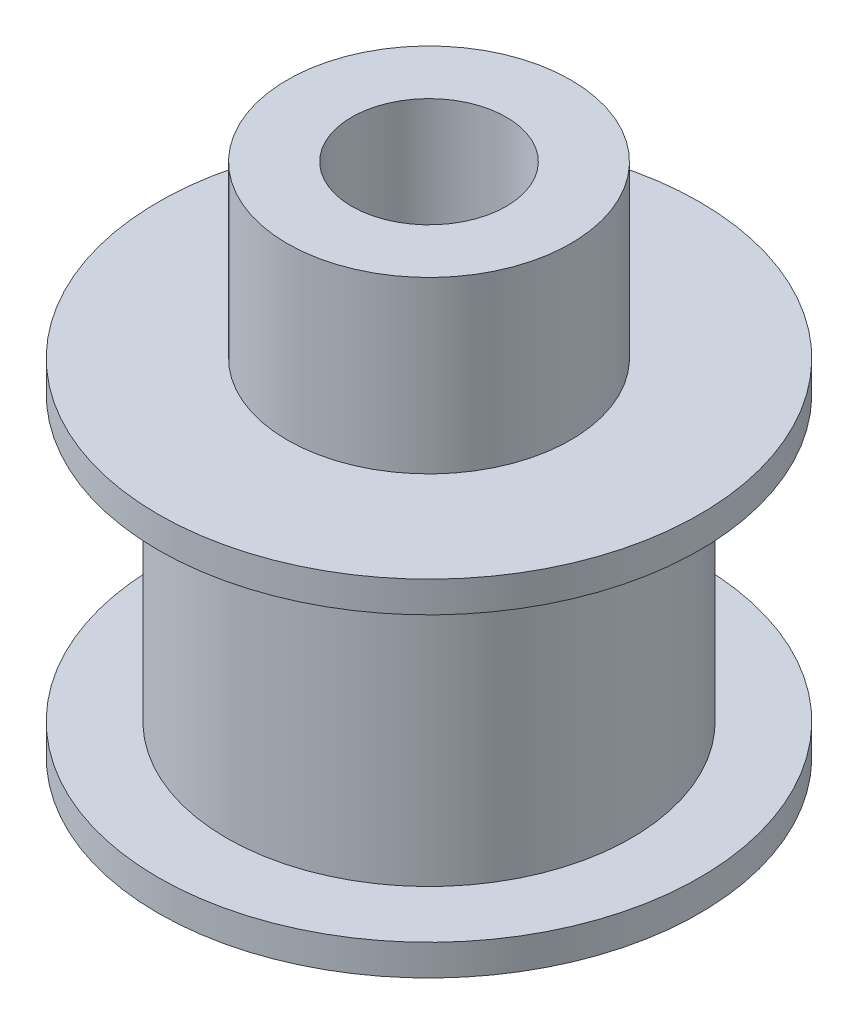
ISO-10303-21;
HEADER;
FILE_DESCRIPTION(('STEP AP214'),'2;1');
FILE_NAME('part.step','',(''),(''),'','','');
FILE_SCHEMA(('AUTOMOTIVE_DESIGN { 1 0 10303 214 1 1 1 1 }'));
ENDSEC;
DATA;
#1=APPLICATION_CONTEXT('core data for automotive mechanical design processes');
#2=APPLICATION_PROTOCOL_DEFINITION('international standard','automotive_design',2000,#1);
#3=PRODUCT_CONTEXT('',#1,'mechanical');
#4=PRODUCT('Part','Part','',(#3));
#5=PRODUCT_RELATED_PRODUCT_CATEGORY('part','',(#4));
#6=PRODUCT_DEFINITION_FORMATION('','',#4);
#7=PRODUCT_DEFINITION_CONTEXT('part definition',#1,'design');
#8=PRODUCT_DEFINITION('design','',#6,#7);
#9=PRODUCT_DEFINITION_SHAPE('','',#8);
#10=(LENGTH_UNIT() NAMED_UNIT(*) SI_UNIT(.MILLI.,.METRE.));
#11=(NAMED_UNIT(*) PLANE_ANGLE_UNIT() SI_UNIT($,.RADIAN.));
#12=(NAMED_UNIT(*) SI_UNIT($,.STERADIAN.) SOLID_ANGLE_UNIT());
#13=UNCERTAINTY_MEASURE_WITH_UNIT(LENGTH_MEASURE(1.E-05),#10,'distance_accuracy_value','');
#14=(GEOMETRIC_REPRESENTATION_CONTEXT(3) GLOBAL_UNCERTAINTY_ASSIGNED_CONTEXT((#13)) GLOBAL_UNIT_ASSIGNED_CONTEXT((#10,
#11,#12)) REPRESENTATION_CONTEXT('',''));
#15=CARTESIAN_POINT('',(0.,0.,0.));
#16=DIRECTION('',(0.,0.,1.));
#17=DIRECTION('',(1.,0.,0.));
#18=AXIS2_PLACEMENT_3D('',#15,#16,#17);
#19=CARTESIAN_POINT('',(0.,1.2,0.));
#20=DIRECTION('',(0.,-1.,0.));
#21=DIRECTION('',(0.,0.,-1.));
#22=AXIS2_PLACEMENT_3D('',#19,#20,#21);
#23=CYLINDRICAL_SURFACE('',#22,10.5);
#24=CARTESIAN_POINT('',(0.,1.2,0.));
#25=DIRECTION('',(0.,1.,0.));
#26=DIRECTION('',(0.,0.,1.));
#27=AXIS2_PLACEMENT_3D('',#24,#25,#26);
#28=CIRCLE('',#27,10.5);
#29=CARTESIAN_POINT('',(0.,1.2,10.5));
#30=VERTEX_POINT('',#29);
#31=EDGE_CURVE('E10',#30,#30,#28,.T.);
#32=ORIENTED_EDGE('',*,*,#31,.F.);
#33=EDGE_LOOP('',(#32));
#34=FACE_BOUND('',#33,.T.);
#35=CARTESIAN_POINT('',(0.,0.,0.));
#36=DIRECTION('',(0.,1.,0.));
#37=DIRECTION('',(0.,0.,1.));
#38=AXIS2_PLACEMENT_3D('',#35,#36,#37);
#39=CIRCLE('',#38,10.5);
#40=CARTESIAN_POINT('',(0.,0.,10.5));
#41=VERTEX_POINT('',#40);
#42=EDGE_CURVE('E33',#41,#41,#39,.T.);
#43=ORIENTED_EDGE('',*,*,#42,.T.);
#44=EDGE_LOOP('',(#43));
#45=FACE_BOUND('',#44,.T.);
#46=ADVANCED_FACE('F30',(#34,#45),#23,.T.);
#47=CARTESIAN_POINT('',(0.,1.2,0.));
#48=DIRECTION('',(0.,1.,0.));
#49=DIRECTION('',(0.,0.,1.));
#50=AXIS2_PLACEMENT_3D('',#47,#48,#49);
#51=PLANE('',#50);
#52=CARTESIAN_POINT('',(0.,1.2,0.));
#53=DIRECTION('',(0.,1.,0.));
#54=DIRECTION('',(0.,0.,1.));
#55=AXIS2_PLACEMENT_3D('',#52,#53,#54);
#56=CIRCLE('',#55,7.85);
#57=CARTESIAN_POINT('',(0.,1.2,7.85));
#58=VERTEX_POINT('',#57);
#59=EDGE_CURVE('E42',#58,#58,#56,.T.);
#60=ORIENTED_EDGE('',*,*,#59,.F.);
#61=EDGE_LOOP('',(#60));
#62=FACE_BOUND('',#61,.T.);
#63=ORIENTED_EDGE('',*,*,#31,.T.);
#64=EDGE_LOOP('',(#63));
#65=FACE_BOUND('',#64,.T.);
#66=ADVANCED_FACE('F107',(#62,#65),#51,.T.);
#67=CARTESIAN_POINT('',(0.,0.,0.));
#68=DIRECTION('',(0.,1.,0.));
#69=DIRECTION('',(0.,0.,1.));
#70=AXIS2_PLACEMENT_3D('',#67,#68,#69);
#71=PLANE('',#70);
#72=CARTESIAN_POINT('',(0.,0.,0.));
#73=DIRECTION('',(0.,1.,0.));
#74=DIRECTION('',(0.,0.,1.));
#75=AXIS2_PLACEMENT_3D('',#72,#73,#74);
#76=CIRCLE('',#75,3.);
#77=CARTESIAN_POINT('',(0.,0.,3.));
#78=VERTEX_POINT('',#77);
#79=EDGE_CURVE('E57',#78,#78,#76,.T.);
#80=ORIENTED_EDGE('',*,*,#79,.T.);
#81=EDGE_LOOP('',(#80));
#82=FACE_BOUND('',#81,.T.);
#83=ORIENTED_EDGE('',*,*,#42,.F.);
#84=EDGE_LOOP('',(#83));
#85=FACE_BOUND('',#84,.T.);
#86=ADVANCED_FACE('F66',(#82,#85),#71,.F.);
#87=CARTESIAN_POINT('',(0.,12.2,0.));
#88=DIRECTION('',(0.,-1.,0.));
#89=DIRECTION('',(0.,0.,-1.));
#90=AXIS2_PLACEMENT_3D('',#87,#88,#89);
#91=CYLINDRICAL_SURFACE('',#90,7.85);
#92=CARTESIAN_POINT('',(0.,12.2,0.));
#93=DIRECTION('',(0.,1.,0.));
#94=DIRECTION('',(0.,0.,1.));
#95=AXIS2_PLACEMENT_3D('',#92,#93,#94);
#96=CIRCLE('',#95,7.85);
#97=CARTESIAN_POINT('',(0.,12.2,7.85));
#98=VERTEX_POINT('',#97);
#99=EDGE_CURVE('E40',#98,#98,#96,.T.);
#100=ORIENTED_EDGE('',*,*,#99,.F.);
#101=EDGE_LOOP('',(#100));
#102=FACE_BOUND('',#101,.T.);
#103=ORIENTED_EDGE('',*,*,#59,.T.);
#104=EDGE_LOOP('',(#103));
#105=FACE_BOUND('',#104,.T.);
#106=ADVANCED_FACE('F97',(#102,#105),#91,.T.);
#107=CARTESIAN_POINT('',(0.,13.4,0.));
#108=DIRECTION('',(0.,-1.,0.));
#109=DIRECTION('',(0.,0.,-1.));
#110=AXIS2_PLACEMENT_3D('',#107,#108,#109);
#111=CYLINDRICAL_SURFACE('',#110,10.5);
#112=CARTESIAN_POINT('',(0.,13.4,0.));
#113=DIRECTION('',(0.,1.,0.));
#114=DIRECTION('',(0.,0.,1.));
#115=AXIS2_PLACEMENT_3D('',#112,#113,#114);
#116=CIRCLE('',#115,10.5);
#117=CARTESIAN_POINT('',(0.,13.4,10.5));
#118=VERTEX_POINT('',#117);
#119=EDGE_CURVE('E45',#118,#118,#116,.T.);
#120=ORIENTED_EDGE('',*,*,#119,.F.);
#121=EDGE_LOOP('',(#120));
#122=FACE_BOUND('',#121,.T.);
#123=CARTESIAN_POINT('',(0.,12.2,0.));
#124=DIRECTION('',(0.,1.,0.));
#125=DIRECTION('',(0.,0.,1.));
#126=AXIS2_PLACEMENT_3D('',#123,#124,#125);
#127=CIRCLE('',#126,10.5);
#128=CARTESIAN_POINT('',(0.,12.2,10.5));
#129=VERTEX_POINT('',#128);
#130=EDGE_CURVE('E48',#129,#129,#127,.T.);
#131=ORIENTED_EDGE('',*,*,#130,.T.);
#132=EDGE_LOOP('',(#131));
#133=FACE_BOUND('',#132,.T.);
#134=ADVANCED_FACE('F91',(#122,#133),#111,.T.);
#135=CARTESIAN_POINT('',(0.,13.4,0.));
#136=DIRECTION('',(0.,1.,0.));
#137=DIRECTION('',(0.,0.,1.));
#138=AXIS2_PLACEMENT_3D('',#135,#136,#137);
#139=PLANE('',#138);
#140=CARTESIAN_POINT('',(0.,13.4,0.));
#141=DIRECTION('',(0.,1.,0.));
#142=DIRECTION('',(0.,0.,1.));
#143=AXIS2_PLACEMENT_3D('',#140,#141,#142);
#144=CIRCLE('',#143,5.5);
#145=CARTESIAN_POINT('',(0.,13.4,5.5));
#146=VERTEX_POINT('',#145);
#147=EDGE_CURVE('E54',#146,#146,#144,.T.);
#148=ORIENTED_EDGE('',*,*,#147,.F.);
#149=EDGE_LOOP('',(#148));
#150=FACE_BOUND('',#149,.T.);
#151=ORIENTED_EDGE('',*,*,#119,.T.);
#152=EDGE_LOOP('',(#151));
#153=FACE_BOUND('',#152,.T.);
#154=ADVANCED_FACE('F88',(#150,#153),#139,.T.);
#155=CARTESIAN_POINT('',(0.,12.2,0.));
#156=DIRECTION('',(0.,1.,0.));
#157=DIRECTION('',(0.,0.,1.));
#158=AXIS2_PLACEMENT_3D('',#155,#156,#157);
#159=PLANE('',#158);
#160=ORIENTED_EDGE('',*,*,#99,.T.);
#161=EDGE_LOOP('',(#160));
#162=FACE_BOUND('',#161,.T.);
#163=ORIENTED_EDGE('',*,*,#130,.F.);
#164=EDGE_LOOP('',(#163));
#165=FACE_BOUND('',#164,.T.);
#166=ADVANCED_FACE('F84',(#162,#165),#159,.F.);
#167=CARTESIAN_POINT('',(0.,20.,0.));
#168=DIRECTION('',(0.,-1.,0.));
#169=DIRECTION('',(0.,0.,-1.));
#170=AXIS2_PLACEMENT_3D('',#167,#168,#169);
#171=CYLINDRICAL_SURFACE('',#170,5.5);
#172=CARTESIAN_POINT('',(0.,20.,0.));
#173=DIRECTION('',(0.,1.,0.));
#174=DIRECTION('',(0.,0.,1.));
#175=AXIS2_PLACEMENT_3D('',#172,#173,#174);
#176=CIRCLE('',#175,5.5);
#177=CARTESIAN_POINT('',(0.,20.,5.5));
#178=VERTEX_POINT('',#177);
#179=EDGE_CURVE('E51',#178,#178,#176,.T.);
#180=ORIENTED_EDGE('',*,*,#179,.F.);
#181=EDGE_LOOP('',(#180));
#182=FACE_BOUND('',#181,.T.);
#183=ORIENTED_EDGE('',*,*,#147,.T.);
#184=EDGE_LOOP('',(#183));
#185=FACE_BOUND('',#184,.T.);
#186=ADVANCED_FACE('F78',(#182,#185),#171,.T.);
#187=CARTESIAN_POINT('',(0.,20.,0.));
#188=DIRECTION('',(0.,1.,0.));
#189=DIRECTION('',(0.,0.,1.));
#190=AXIS2_PLACEMENT_3D('',#187,#188,#189);
#191=PLANE('',#190);
#192=CARTESIAN_POINT('',(0.,20.,0.));
#193=DIRECTION('',(0.,1.,0.));
#194=DIRECTION('',(0.,0.,1.));
#195=AXIS2_PLACEMENT_3D('',#192,#193,#194);
#196=CIRCLE('',#195,3.);
#197=CARTESIAN_POINT('',(0.,20.,3.));
#198=VERTEX_POINT('',#197);
#199=EDGE_CURVE('E60',#198,#198,#196,.T.);
#200=ORIENTED_EDGE('',*,*,#199,.F.);
#201=EDGE_LOOP('',(#200));
#202=FACE_BOUND('',#201,.T.);
#203=ORIENTED_EDGE('',*,*,#179,.T.);
#204=EDGE_LOOP('',(#203));
#205=FACE_BOUND('',#204,.T.);
#206=ADVANCED_FACE('F72',(#202,#205),#191,.T.);
#207=CARTESIAN_POINT('',(0.,0.,0.));
#208=DIRECTION('',(0.,1.,0.));
#209=DIRECTION('',(0.,0.,1.));
#210=AXIS2_PLACEMENT_3D('',#207,#208,#209);
#211=CYLINDRICAL_SURFACE('',#210,3.);
#212=ORIENTED_EDGE('',*,*,#79,.F.);
#213=EDGE_LOOP('',(#212));
#214=FACE_BOUND('',#213,.T.);
#215=ORIENTED_EDGE('',*,*,#199,.T.);
#216=EDGE_LOOP('',(#215));
#217=FACE_BOUND('',#216,.T.);
#218=ADVANCED_FACE('F69',(#214,#217),#211,.F.);
#219=CLOSED_SHELL('',(#46,#66,#86,#106,#134,#154,#166,#186,#206,#218));
#220=MANIFOLD_SOLID_BREP('B2',#219);
#221=ADVANCED_BREP_SHAPE_REPRESENTATION('',(#18,#220),#14);
#222=SHAPE_DEFINITION_REPRESENTATION(#9,#221);
ENDSEC;
END-ISO-10303-21;
